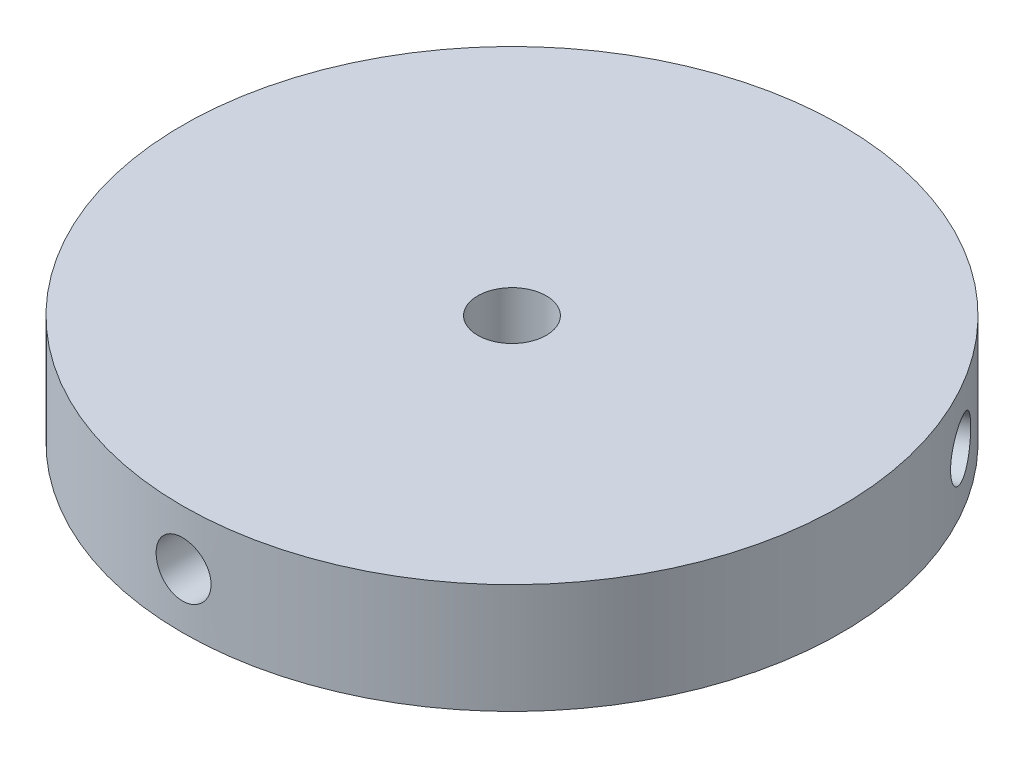
ISO-10303-21;
HEADER;
FILE_DESCRIPTION(('STEP AP214'),'2;1');
FILE_NAME('part.step','',(''),(''),'','','');
FILE_SCHEMA(('AUTOMOTIVE_DESIGN { 1 0 10303 214 1 1 1 1 }'));
ENDSEC;
DATA;
#1=APPLICATION_CONTEXT('core data for automotive mechanical design processes');
#2=APPLICATION_PROTOCOL_DEFINITION('international standard','automotive_design',2000,#1);
#3=PRODUCT_CONTEXT('',#1,'mechanical');
#4=PRODUCT('Part','Part','',(#3));
#5=PRODUCT_RELATED_PRODUCT_CATEGORY('part','',(#4));
#6=PRODUCT_DEFINITION_FORMATION('','',#4);
#7=PRODUCT_DEFINITION_CONTEXT('part definition',#1,'design');
#8=PRODUCT_DEFINITION('design','',#6,#7);
#9=PRODUCT_DEFINITION_SHAPE('','',#8);
#10=(LENGTH_UNIT() NAMED_UNIT(*) SI_UNIT(.MILLI.,.METRE.));
#11=(NAMED_UNIT(*) PLANE_ANGLE_UNIT() SI_UNIT($,.RADIAN.));
#12=(NAMED_UNIT(*) SI_UNIT($,.STERADIAN.) SOLID_ANGLE_UNIT());
#13=UNCERTAINTY_MEASURE_WITH_UNIT(LENGTH_MEASURE(1.E-05),#10,'distance_accuracy_value','');
#14=(GEOMETRIC_REPRESENTATION_CONTEXT(3) GLOBAL_UNCERTAINTY_ASSIGNED_CONTEXT((#13)) GLOBAL_UNIT_ASSIGNED_CONTEXT((#10,
#11,#12)) REPRESENTATION_CONTEXT('',''));
#15=CARTESIAN_POINT('',(0.,0.,0.));
#16=DIRECTION('',(0.,0.,1.));
#17=DIRECTION('',(1.,0.,0.));
#18=AXIS2_PLACEMENT_3D('',#15,#16,#17);
#19=CARTESIAN_POINT('',(0.,12.7,0.));
#20=DIRECTION('',(0.,-1.,0.));
#21=DIRECTION('',(0.,0.,-1.));
#22=AXIS2_PLACEMENT_3D('',#19,#20,#21);
#23=CYLINDRICAL_SURFACE('',#22,38.1);
#24=CARTESIAN_POINT('',(-34.4683003438176,6.35,-16.234108272658));
#25=CARTESIAN_POINT('',(-34.468297976072,6.17199137458612,-16.2341158847225));
#26=CARTESIAN_POINT('',(-34.4618858552339,5.99386156393523,-16.2477491989941));
#27=CARTESIAN_POINT('',(-34.4363107400014,5.6425305603963,-16.3018822251044));
#28=CARTESIAN_POINT('',(-34.4171332977316,5.46933518421718,-16.3424123788068));
#29=CARTESIAN_POINT('',(-34.366317077365,5.13301235230676,-16.4490034875303));
#30=CARTESIAN_POINT('',(-34.3346853637724,4.96987924946927,-16.5150499683885));
#31=CARTESIAN_POINT('',(-34.2594606629624,4.65822285520727,-16.6705362232467));
#32=CARTESIAN_POINT('',(-34.2158702328494,4.50969644967991,-16.7599709959922));
#33=CARTESIAN_POINT('',(-34.1173366400696,4.23104944026374,-16.9596499740052));
#34=CARTESIAN_POINT('',(-34.0623678606117,4.10097150383517,-17.0699410851632));
#35=CARTESIAN_POINT('',(-33.9421339071305,3.86328041719418,-17.3077804703171));
#36=CARTESIAN_POINT('',(-33.8768682834768,3.7556682484669,-17.4353294978764));
#37=CARTESIAN_POINT('',(-33.737247058231,3.56582149846664,-17.7039847598704));
#38=CARTESIAN_POINT('',(-33.6628784508303,3.4836238328989,-17.8451103286139));
#39=CARTESIAN_POINT('',(-33.5067820799427,3.34717551569876,-18.1365058689404));
#40=CARTESIAN_POINT('',(-33.425054445295,3.2929243749007,-18.2867756804144));
#41=CARTESIAN_POINT('',(-33.2564466136483,3.21403191375709,-18.5916382872039));
#42=CARTESIAN_POINT('',(-33.1695789285619,3.18932156419576,-18.7462201371918));
#43=CARTESIAN_POINT('',(-32.9928446235063,3.16999872988892,-19.0555484684848));
#44=CARTESIAN_POINT('',(-32.9029780593362,3.17538568544306,-19.2102949466749));
#45=CARTESIAN_POINT('',(-32.7230679421953,3.2160480896695,-19.5151758231526));
#46=CARTESIAN_POINT('',(-32.6330253824259,3.25124930712833,-19.6653207172342));
#47=CARTESIAN_POINT('',(-32.455300497962,3.35042557930463,-19.9572717533826));
#48=CARTESIAN_POINT('',(-32.3676181957327,3.41440090779409,-20.099077816095));
#49=CARTESIAN_POINT('',(-32.1973421681014,3.56939210910145,-20.3707367785992));
#50=CARTESIAN_POINT('',(-32.1147548504541,3.66044122685106,-20.500574724005));
#51=CARTESIAN_POINT('',(-31.9575816556103,3.86697131601211,-20.7447364600493));
#52=CARTESIAN_POINT('',(-31.8829959407617,3.98245278300083,-20.8590599359205));
#53=CARTESIAN_POINT('',(-31.7442436510404,4.23498784685792,-21.0696221600038));
#54=CARTESIAN_POINT('',(-31.6801094345297,4.3721059459497,-21.1658048829466));
#55=CARTESIAN_POINT('',(-31.5648943395466,4.66379720374434,-21.337247920908));
#56=CARTESIAN_POINT('',(-31.5138134718346,4.81837037683589,-21.4125082186796));
#57=CARTESIAN_POINT('',(-31.4266406902966,5.14062944367546,-21.5402475703534));
#58=CARTESIAN_POINT('',(-31.3905506252527,5.30831695175638,-21.5927238143856));
#59=CARTESIAN_POINT('',(-31.3347797407474,5.65202297981191,-21.6735786683244));
#60=CARTESIAN_POINT('',(-31.315098576307,5.82804132455761,-21.7019577848467));
#61=CARTESIAN_POINT('',(-31.2929612498195,6.18284636731306,-21.7338666549584));
#62=CARTESIAN_POINT('',(-31.290453512958,6.36162315889386,-21.7374708122179));
#63=CARTESIAN_POINT('',(-31.3026261586359,6.71736764108757,-21.7199379609855));
#64=CARTESIAN_POINT('',(-31.3173063808565,6.89433534855898,-21.6988011832619));
#65=CARTESIAN_POINT('',(-31.3632381442978,7.24117917966356,-21.6323577913854));
#66=CARTESIAN_POINT('',(-31.3944658044545,7.41106514343282,-21.5870860080131));
#67=CARTESIAN_POINT('',(-31.4722604845537,7.73922786086988,-21.4735076449162));
#68=CARTESIAN_POINT('',(-31.5188277506256,7.89750442821099,-21.4052006955838));
#69=CARTESIAN_POINT('',(-31.625658837298,8.19836832579616,-21.2470420758724));
#70=CARTESIAN_POINT('',(-31.6859549295945,8.34091749516499,-21.1571396141262));
#71=CARTESIAN_POINT('',(-31.8179507477138,8.6058944623792,-20.9581066008706));
#72=CARTESIAN_POINT('',(-31.8896506697629,8.72832191391536,-20.8489757184932));
#73=CARTESIAN_POINT('',(-32.0420834770884,8.94988813831987,-20.6139398677302));
#74=CARTESIAN_POINT('',(-32.1228383636178,9.04896829078491,-20.487993895069));
#75=CARTESIAN_POINT('',(-32.2904465552361,9.22062517556742,-20.2227998330557));
#76=CARTESIAN_POINT('',(-32.377299799374,9.29320217273015,-20.0835518766475));
#77=CARTESIAN_POINT('',(-32.5541201892432,9.40969188167104,-19.7956494489558));
#78=CARTESIAN_POINT('',(-32.6440832445007,9.45364084358803,-19.64700713605));
#79=CARTESIAN_POINT('',(-32.8244027035133,9.51174540926925,-19.344239928858));
#80=CARTESIAN_POINT('',(-32.9147590997906,9.52590157697375,-19.1901151384045));
#81=CARTESIAN_POINT('',(-33.0929247371073,9.5240121317669,-18.8812083842368));
#82=CARTESIAN_POINT('',(-33.1807408649056,9.50805787666263,-18.7264298255141));
#83=CARTESIAN_POINT('',(-33.3517134701532,9.44659097942587,-18.4202055558323));
#84=CARTESIAN_POINT('',(-33.4348699412735,9.40107829714634,-18.2687598494003));
#85=CARTESIAN_POINT('',(-33.5944347904347,9.28180969986148,-17.9736504896075));
#86=CARTESIAN_POINT('',(-33.6708435602687,9.20805542598165,-17.8299863846097));
#87=CARTESIAN_POINT('',(-33.8151803195636,9.03440774586235,-17.554707776923));
#88=CARTESIAN_POINT('',(-33.8831084431136,8.93451475298456,-17.4230930837273));
#89=CARTESIAN_POINT('',(-34.0092744881184,8.71108235285415,-17.1755245228764));
#90=CARTESIAN_POINT('',(-34.0674837960204,8.58747534677471,-17.0596170818987));
#91=CARTESIAN_POINT('',(-34.1728976712499,8.32024571429507,-16.8474667977872));
#92=CARTESIAN_POINT('',(-34.220099569994,8.17661824768683,-16.7512287238978));
#93=CARTESIAN_POINT('',(-34.3027503932169,7.87314592277449,-16.5813234295435));
#94=CARTESIAN_POINT('',(-34.33817712972,7.71327118124604,-16.5076988393264));
#95=CARTESIAN_POINT('',(-34.396560379629,7.38216888836766,-16.3857026218159));
#96=CARTESIAN_POINT('',(-34.4195312309533,7.21095464582547,-16.3373019618688));
#97=CARTESIAN_POINT('',(-34.4468260209622,6.92394194257855,-16.2796425921257));
#98=CARTESIAN_POINT('',(-34.4548726122663,6.80998938742769,-16.2625924758709));
#99=CARTESIAN_POINT('',(-34.4656105338472,6.5807081899202,-16.2398228644119));
#100=CARTESIAN_POINT('',(-34.4683018785153,6.46537955126236,-16.234103338759));
#101=CARTESIAN_POINT('',(-34.4683003438176,6.35,-16.234108272658));
#102=B_SPLINE_CURVE_WITH_KNOTS('',3,(#24,#25,#26,#27,#28,#29,#30,#31,#32,#33,#34,#35,#36,#37,
#38,#39,#40,#41,#42,#43,#44,#45,#46,#47,#48,#49,#50,#51,#52,#53,#54,#55,#56,#57,#58,#59,#60,#61,
#62,#63,#64,#65,#66,#67,#68,#69,#70,#71,#72,#73,#74,#75,#76,#77,#78,#79,#80,#81,#82,#83,#84,#85,
#86,#87,#88,#89,#90,#91,#92,#93,#94,#95,#96,#97,#98,#99,#100,#101),.UNSPECIFIED.,.T.,.F.,(4,2,2,
2,2,2,2,2,2,2,2,2,2,2,2,2,2,2,2,2,2,2,2,2,2,2,2,2,2,2,2,2,2,2,2,2,2,2,4),(0.,0.533604603517505,
1.06781417349037,1.60172115641093,2.13551406411709,2.67052206526964,3.2055534349789,
3.74135834978334,4.27715388573729,4.81169494296256,5.34622605970216,5.87943020597204,
6.41263942553357,6.94650611589525,7.4803836360617,8.01588389273743,8.55138459084429,
9.08695131145285,9.62250677207596,10.1564531576629,10.6903945629631,11.2235674807547,
11.7567489539102,12.2911969327788,12.8256541089181,13.3614392326626,13.8972190021753,
14.4323190169852,14.9674089029308,15.5008778862256,16.0343475940937,16.5677863066157,
17.1012165837663,17.6361906712906,18.1712943208452,18.7074006261176,19.2428885044878,
19.5887550320896,19.9346206302438),.UNSPECIFIED.);
#103=CARTESIAN_POINT('',(-34.4683003438176,6.35,-16.234108272658));
#104=VERTEX_POINT('',#103);
#105=EDGE_CURVE('E10',#104,#104,#102,.T.);
#106=ORIENTED_EDGE('',*,*,#105,.T.);
#107=EDGE_LOOP('',(#106));
#108=FACE_BOUND('',#107,.T.);
#109=CARTESIAN_POINT('',(31.2933003438179,6.35,-21.7333695866888));
#110=CARTESIAN_POINT('',(31.2933057521863,6.17199137458612,-21.7333637301287));
#111=CARTESIAN_POINT('',(31.3019064882642,5.99386156393522,-21.7209940134549));
#112=CARTESIAN_POINT('',(31.3359995064432,5.64253056039629,-21.6717788009038));
#113=CARTESIAN_POINT('',(31.3615109280339,5.46933518421718,-21.6349055718673));
#114=CARTESIAN_POINT('',(31.4284134258227,5.13301235230676,-21.5376018797438));
#115=CARTESIAN_POINT('',(31.4697954992801,4.96987924946927,-21.4771847717782));
#116=CARTESIAN_POINT('',(31.5668381955216,4.65822285520726,-21.3342951424556));
#117=CARTESIAN_POINT('',(31.6224957656445,4.50969644967991,-21.2518273362431));
#118=CARTESIAN_POINT('',(31.7461560368155,4.23104944026373,-21.0666552527631));
#119=CARTESIAN_POINT('',(31.814186551161,4.10097150383517,-20.9639053377586));
#120=CARTESIAN_POINT('',(31.9600445239842,3.86328041719418,-20.7408599870694));
#121=CARTESIAN_POINT('',(32.0378724102517,3.75566824846689,-20.6205637852119));
#122=CARTESIAN_POINT('',(32.2007240793759,3.56582149846664,-20.3653206262446));
#123=CARTESIAN_POINT('',(32.2857581033309,3.4836238328989,-20.2303527386197));
#124=CARTESIAN_POINT('',(32.4600658583594,3.34717551569876,-19.9494715458292));
#125=CARTESIAN_POINT('',(32.549339515194,3.29292437490069,-19.8035584322961));
#126=CARTESIAN_POINT('',(32.7290543615143,3.21403191375709,-19.5051084634183));
#127=CARTESIAN_POINT('',(32.8194923280245,3.18932156419576,-19.3525879163716));
#128=CARTESIAN_POINT('',(32.9990113685067,3.16999872988893,-19.0448673528267));
#129=CARTESIAN_POINT('',(33.0880924676805,3.17538568544306,-18.8896673862095));
#130=CARTESIAN_POINT('',(33.2621719932678,3.2160480896695,-18.5814202161288));
#131=CARTESIAN_POINT('',(33.3471800059062,3.25124930712834,-18.428368624906));
#132=CARTESIAN_POINT('',(33.5111545776401,3.35042557930463,-18.1284788420014));
#133=CARTESIAN_POINT('',(33.590121079245,3.41440090779409,-17.9816407094523));
#134=CARTESIAN_POINT('',(33.7402466281236,3.56939210910145,-17.698347862616));
#135=CARTESIAN_POINT('',(33.8113959283966,3.66044122685107,-17.5619061748001));
#136=CARTESIAN_POINT('',(33.9442595970212,3.86697131601212,-17.3037093272493));
#137=CARTESIAN_POINT('',(34.0059737739503,3.98245278300083,-17.1819544654954));
#138=CARTESIAN_POINT('',(34.1189498642232,4.23498784685792,-16.9565103457218));
#139=CARTESIAN_POINT('',(34.1701794374414,4.37210594594971,-16.8528771235003));
#140=CARTESIAN_POINT('',(34.2610459161264,4.66379720374434,-16.6673764053648));
#141=CARTESIAN_POINT('',(34.300682812037,4.81837037683589,-16.5855089273931));
#142=CARTESIAN_POINT('',(34.3677219448804,5.14062944367546,-16.4461454082257));
#143=CARTESIAN_POINT('',(34.3951226727856,5.30831695175639,-16.3886523730573));
#144=CARTESIAN_POINT('',(34.4372595880632,5.65202297981191,-16.2999259433149));
#145=CARTESIAN_POINT('',(34.4519960416883,5.82804132455762,-16.2686919966723));
#146=CARTESIAN_POINT('',(34.4685612705673,6.18284636731306,-16.2335660745064));
#147=CARTESIAN_POINT('',(34.4704286938825,6.36162315889387,-16.2295922320485));
#148=CARTESIAN_POINT('',(34.4613311221534,6.71736764108758,-16.248900478053));
#149=CARTESIAN_POINT('',(34.450366246801,6.89433534855898,-16.2721823122911));
#150=CARTESIAN_POINT('',(34.4157904632429,7.24117917966356,-16.3451820822102));
#151=CARTESIAN_POINT('',(34.3921977788462,7.41106514343282,-16.3948619208927));
#152=CARTESIAN_POINT('',(34.3327333711337,7.73922786086988,-16.5190232716864));
#153=CARTESIAN_POINT('',(34.2968614507928,7.89750442821099,-16.5935051817556));
#154=CARTESIAN_POINT('',(34.2133076116314,8.19836832579616,-16.7651029265836));
#155=CARTESIAN_POINT('',(34.1655978420447,8.34091749516499,-16.8622721051343));
#156=CARTESIAN_POINT('',(34.0592281054333,8.6058944623792,-17.0761003434467));
#157=CARTESIAN_POINT('',(34.0005679499816,8.72832191391536,-17.1927597385793));
#158=CARTESIAN_POINT('',(33.8732373360834,8.94988813831987,-17.4422883474749));
#159=CARTESIAN_POINT('',(33.8045423675193,9.04896829078491,-17.5751971170197));
#160=CARTESIAN_POINT('',(33.6586816686921,9.22062517556742,-17.8529470998502));
#161=CARTESIAN_POINT('',(33.5815160230864,9.29320217273015,-17.9977881938788));
#162=CARTESIAN_POINT('',(33.4205954018288,9.40969188167104,-18.2948703572584));
#163=CARTESIAN_POINT('',(33.3368489104038,9.45364084358803,-18.4471018049664));
#164=CARTESIAN_POINT('',(33.1648045470491,9.51174540926925,-18.754646640864));
#165=CARTESIAN_POINT('',(33.076506761302,9.52590157697375,-18.9099599706613));
#166=CARTESIAN_POINT('',(32.8980684834506,9.5240121317669,-19.2187093157428));
#167=CARTESIAN_POINT('',(32.8079343835347,9.50805787666263,-19.3721495926395));
#168=CARTESIAN_POINT('',(32.6282226893587,9.44659097942587,-19.673328346976));
#169=CARTESIAN_POINT('',(32.5386450958546,9.40107829714634,-19.8210668166712));
#170=CARTESIAN_POINT('',(32.3628553179602,9.28180969986148,-20.1068087094923));
#171=CARTESIAN_POINT('',(32.2766429383371,9.20805542598165,-20.2448126977393));
#172=CARTESIAN_POINT('',(32.1104130506095,9.03440774586234,-20.507451301832));
#173=CARTESIAN_POINT('',(32.0303954445657,8.93451475298456,-20.6320861290556));
#174=CARTESIAN_POINT('',(31.8790778041928,8.71108235285415,-20.8651334095502));
#175=CARTESIAN_POINT('',(31.8078036697695,8.58747534677471,-20.9734978694189));
#176=CARTESIAN_POINT('',(31.6767830719237,8.32024571429507,-21.1708641053348));
#177=CARTESIAN_POINT('',(31.6170394044961,8.17661824768683,-21.2598611856987));
#178=CARTESIAN_POINT('',(31.5112225149593,7.87314592277449,-21.4163915454306));
#179=CARTESIAN_POINT('',(31.4651751177397,7.71327118124604,-21.483884294324));
#180=CARTESIAN_POINT('',(31.3887149191645,7.38216888836766,-21.5954437806559));
#181=CARTESIAN_POINT('',(31.3582841437524,7.21095464582547,-21.6395374514229));
#182=CARTESIAN_POINT('',(31.3219970597932,6.92394194257855,-21.6920051178331));
#183=CARTESIAN_POINT('',(31.3112545216311,6.80998938742769,-21.7074987284437));
#184=CARTESIAN_POINT('',(31.2969044204638,6.5807081899202,-21.7281828470462));
#185=CARTESIAN_POINT('',(31.2932968382848,6.46537955126235,-21.7333733827254));
#186=CARTESIAN_POINT('',(31.2933003438179,6.35,-21.7333695866888));
#187=B_SPLINE_CURVE_WITH_KNOTS('',3,(#109,#110,#111,#112,#113,#114,#115,#116,#117,#118,#119,
#120,#121,#122,#123,#124,#125,#126,#127,#128,#129,#130,#131,#132,#133,#134,#135,#136,#137,#138,
#139,#140,#141,#142,#143,#144,#145,#146,#147,#148,#149,#150,#151,#152,#153,#154,#155,#156,#157,
#158,#159,#160,#161,#162,#163,#164,#165,#166,#167,#168,#169,#170,#171,#172,#173,#174,#175,#176,
#177,#178,#179,#180,#181,#182,#183,#184,#185,#186),.UNSPECIFIED.,.T.,.F.,(4,2,2,2,2,2,2,2,2,2,2,
2,2,2,2,2,2,2,2,2,2,2,2,2,2,2,2,2,2,2,2,2,2,2,2,2,2,2,4),(0.,0.533604603517509,1.06781417349037,
1.60172115641093,2.13551406411709,2.67052206526965,3.2055534349789,3.74135834978334,
4.27715388573729,4.81169494296257,5.34622605970217,5.87943020597204,6.41263942553357,
6.94650611589526,7.48038363606171,8.01588389273743,8.55138459084429,9.08695131145285,
9.62250677207596,10.1564531576629,10.6903945629631,11.2235674807547,11.7567489539102,
12.2911969327788,12.8256541089181,13.3614392326626,13.8972190021753,14.4323190169852,
14.9674089029308,15.5008778862256,16.0343475940937,16.5677863066157,17.1012165837663,
17.6361906712906,18.1712943208452,18.7074006261176,19.2428885044878,19.5887550320896,
19.9346206302438),.UNSPECIFIED.);
#188=CARTESIAN_POINT('',(31.2933003438179,6.35,-21.7333695866888));
#189=VERTEX_POINT('',#188);
#190=EDGE_CURVE('E41',#189,#189,#187,.T.);
#191=ORIENTED_EDGE('',*,*,#190,.T.);
#192=EDGE_LOOP('',(#191));
#193=FACE_BOUND('',#192,.T.);
#194=CARTESIAN_POINT('',(3.175,6.35,37.9674778593469));
#195=CARTESIAN_POINT('',(3.174992223886,6.17199137458612,37.9674796148514));
#196=CARTESIAN_POINT('',(3.15997936696993,5.99386156393522,37.9687432124492));
#197=CARTESIAN_POINT('',(3.10031123355846,5.6425305603963,37.9736610260084));
#198=CARTESIAN_POINT('',(3.05562236969804,5.46933518421718,37.9773179506743));
#199=CARTESIAN_POINT('',(2.93790365154258,5.13301235230676,37.9866053672742));
#200=CARTESIAN_POINT('',(2.86488986449255,4.96987924946927,37.9922347401668));
#201=CARTESIAN_POINT('',(2.69262246744107,4.65822285520727,38.0048313657024));
#202=CARTESIAN_POINT('',(2.59337446720523,4.50969644967991,38.0117983322355));
#203=CARTESIAN_POINT('',(2.37118060325433,4.23104944026373,38.0263052267685));
#204=CARTESIAN_POINT('',(2.24818130945098,4.10097150383517,38.033846422922));
#205=CARTESIAN_POINT('',(1.98208938314658,3.86328041719418,38.0486404573867));
#206=CARTESIAN_POINT('',(1.83899587322542,3.75566824846689,38.0558932830884));
#207=CARTESIAN_POINT('',(1.53652297885541,3.56582149846664,38.0693053861151));
#208=CARTESIAN_POINT('',(1.3771203474996,3.4836238328989,38.0754630672337));
#209=CARTESIAN_POINT('',(1.04671622158357,3.34717551569876,38.0859774147697));
#210=CARTESIAN_POINT('',(0.875714930101313,3.29292437490069,38.0903341127107));
#211=CARTESIAN_POINT('',(0.5273922521343,3.21403191375709,38.0967467506223));
#212=CARTESIAN_POINT('',(0.350086600537621,3.18932156419576,38.0988080535635));
#213=CARTESIAN_POINT('',(-0.00616674500017653,3.16999872988893,38.1004158213116));
#214=CARTESIAN_POINT('',(-0.185114408344067,3.17538568544306,38.0999623328846));
#215=CARTESIAN_POINT('',(-0.539104051072237,3.2160480896695,38.0965960392816));
#216=CARTESIAN_POINT('',(-0.71415462348008,3.25124930712834,38.0936893421403));
#217=CARTESIAN_POINT('',(-1.05585407967778,3.35042557930463,38.0857505953842));
#218=CARTESIAN_POINT('',(-1.22250288351202,3.41440090779409,38.0807185255475));
#219=CARTESIAN_POINT('',(-1.54290446002202,3.56939210910145,38.0690846412153));
#220=CARTESIAN_POINT('',(-1.69664107794224,3.66044122685107,38.0624808988053));
#221=CARTESIAN_POINT('',(-1.98667794141065,3.86697131601212,38.0484457872988));
#222=CARTESIAN_POINT('',(-2.12297783318834,3.98245278300083,38.0410144014161));
#223=CARTESIAN_POINT('',(-2.37470621318252,4.23498784685792,38.0261325057258));
#224=CARTESIAN_POINT('',(-2.49007000291146,4.3721059459497,38.0186820064471));
#225=CARTESIAN_POINT('',(-2.69615157657959,4.66379720374434,38.004624326273));
#226=CARTESIAN_POINT('',(-2.78686934020215,4.81837037683589,37.9980171460728));
#227=CARTESIAN_POINT('',(-2.94108125458357,5.14062944367546,37.9863929785793));
#228=CARTESIAN_POINT('',(-3.00457204753268,5.30831695175639,37.9813761874431));
#229=CARTESIAN_POINT('',(-3.10247984731552,5.65202297981191,37.9735046116394));
#230=CARTESIAN_POINT('',(-3.136897465381,5.82804132455761,37.9706497815191));
#231=CARTESIAN_POINT('',(-3.17560002074756,6.18284636731306,37.967432729465));
#232=CARTESIAN_POINT('',(-3.17997518092429,6.36162315889386,37.9670630442666));
#233=CARTESIAN_POINT('',(-3.15870496351731,6.71736764108757,37.9688384390387));
#234=CARTESIAN_POINT('',(-3.13305986594426,6.89433534855898,37.9709834955532));
#235=CARTESIAN_POINT('',(-3.05255231894487,7.24117917966356,37.9775398735957));
#236=CARTESIAN_POINT('',(-2.99773197439151,7.41106514343282,37.981947928906));
#237=CARTESIAN_POINT('',(-2.86047288657974,7.73922786086988,37.9925309166027));
#238=CARTESIAN_POINT('',(-2.77803370016694,7.89750442821099,37.9987058773396));
#239=CARTESIAN_POINT('',(-2.58764877433316,8.19836832579616,38.0121450024561));
#240=CARTESIAN_POINT('',(-2.47964291244999,8.34091749516499,38.0194117192607));
#241=CARTESIAN_POINT('',(-2.24127735771924,8.6058944623792,38.0342069443175));
#242=CARTESIAN_POINT('',(-2.11091728021842,8.72832191391536,38.0417354570727));
#243=CARTESIAN_POINT('',(-1.83115385899479,8.94988813831987,38.0562282152053));
#244=CARTESIAN_POINT('',(-1.68170400390121,9.04896829078492,38.0631910120889));
#245=CARTESIAN_POINT('',(-1.36823511345573,9.22062517556742,38.0757469329061));
#246=CARTESIAN_POINT('',(-1.20421622371214,9.29320217273015,38.0813400705265));
#247=CARTESIAN_POINT('',(-0.866475212585345,9.40969188167104,38.0905198062144));
#248=CARTESIAN_POINT('',(-0.692765665902923,9.45364084358803,38.0941089410165));
#249=CARTESIAN_POINT('',(-0.340401843535498,9.51174540926925,38.0988865697221));
#250=CARTESIAN_POINT('',(-0.161747661511105,9.52590157697375,38.1000751090659));
#251=CARTESIAN_POINT('',(0.194856253656989,9.5240121317669,38.0999176999798));
#252=CARTESIAN_POINT('',(0.37280648137115,9.50805787666263,38.0985794181538));
#253=CARTESIAN_POINT('',(0.723490780794733,9.44659097942587,38.0935339028085));
#254=CARTESIAN_POINT('',(0.89622484541909,9.40107829714634,38.0898266660717));
#255=CARTESIAN_POINT('',(1.23157947247478,9.28180969986148,38.0804591990999));
#256=CARTESIAN_POINT('',(1.39420062193182,9.20805542598165,38.0747990823492));
#257=CARTESIAN_POINT('',(1.70476726895439,9.03440774586234,38.0621590787552));
#258=CARTESIAN_POINT('',(1.85271299854823,8.93451475298456,38.055179212783));
#259=CARTESIAN_POINT('',(2.13019668392583,8.71108235285415,38.0406579324267));
#260=CARTESIAN_POINT('',(2.25968012625115,8.58747534677471,38.0331149513177));
#261=CARTESIAN_POINT('',(2.49611459932655,8.32024571429507,38.0183309031221));
#262=CARTESIAN_POINT('',(2.60306016549813,8.17661824768683,38.0110899095966));
#263=CARTESIAN_POINT('',(2.79152787825786,7.87314592277449,37.9977149749742));
#264=CARTESIAN_POINT('',(2.87300201198062,7.71327118124604,37.9915831336506));
#265=CARTESIAN_POINT('',(3.00784546046481,7.38216888836766,37.981146402472));
#266=CARTESIAN_POINT('',(3.0612470872011,7.21095464582547,37.9768394132918));
#267=CARTESIAN_POINT('',(3.1248289611693,6.92394194257855,37.9716477099589));
#268=CARTESIAN_POINT('',(3.14361809063546,6.80998938742769,37.9700912043147));
#269=CARTESIAN_POINT('',(3.16870611338372,6.5807081899202,37.9680057114582));
#270=CARTESIAN_POINT('',(3.17500504023073,6.46537955126235,37.9674767214846));
#271=CARTESIAN_POINT('',(3.175,6.35,37.9674778593469));
#272=B_SPLINE_CURVE_WITH_KNOTS('',3,(#194,#195,#196,#197,#198,#199,#200,#201,#202,#203,#204,
#205,#206,#207,#208,#209,#210,#211,#212,#213,#214,#215,#216,#217,#218,#219,#220,#221,#222,#223,
#224,#225,#226,#227,#228,#229,#230,#231,#232,#233,#234,#235,#236,#237,#238,#239,#240,#241,#242,
#243,#244,#245,#246,#247,#248,#249,#250,#251,#252,#253,#254,#255,#256,#257,#258,#259,#260,#261,
#262,#263,#264,#265,#266,#267,#268,#269,#270,#271),.UNSPECIFIED.,.T.,.F.,(4,2,2,2,2,2,2,2,2,2,2,
2,2,2,2,2,2,2,2,2,2,2,2,2,2,2,2,2,2,2,2,2,2,2,2,2,2,2,4),(0.,0.533604603517507,1.06781417349037,
1.60172115641093,2.13551406411709,2.67052206526965,3.2055534349789,3.74135834978334,
4.27715388573729,4.81169494296257,5.34622605970216,5.87943020597204,6.41263942553356,
6.94650611589526,7.4803836360617,8.01588389273743,8.55138459084428,9.08695131145285,
9.62250677207596,10.1564531576629,10.6903945629631,11.2235674807547,11.7567489539102,
12.2911969327788,12.8256541089181,13.3614392326626,13.8972190021753,14.4323190169852,
14.9674089029308,15.5008778862256,16.0343475940937,16.5677863066157,17.1012165837663,
17.6361906712906,18.1712943208452,18.7074006261176,19.2428885044878,19.5887550320896,
19.9346206302438),.UNSPECIFIED.);
#273=CARTESIAN_POINT('',(3.175,6.35,37.9674778593469));
#274=VERTEX_POINT('',#273);
#275=EDGE_CURVE('E45',#274,#274,#272,.T.);
#276=ORIENTED_EDGE('',*,*,#275,.T.);
#277=EDGE_LOOP('',(#276));
#278=FACE_BOUND('',#277,.T.);
#279=CARTESIAN_POINT('',(0.,12.7,0.));
#280=DIRECTION('',(0.,1.,0.));
#281=DIRECTION('',(0.,0.,1.));
#282=AXIS2_PLACEMENT_3D('',#279,#280,#281);
#283=CIRCLE('',#282,38.1);
#284=CARTESIAN_POINT('',(0.,12.7,38.1));
#285=VERTEX_POINT('',#284);
#286=EDGE_CURVE('E49',#285,#285,#283,.T.);
#287=ORIENTED_EDGE('',*,*,#286,.F.);
#288=EDGE_LOOP('',(#287));
#289=FACE_BOUND('',#288,.T.);
#290=CARTESIAN_POINT('',(0.,0.,0.));
#291=DIRECTION('',(0.,1.,0.));
#292=DIRECTION('',(0.,0.,1.));
#293=AXIS2_PLACEMENT_3D('',#290,#291,#292);
#294=CIRCLE('',#293,38.1);
#295=CARTESIAN_POINT('',(0.,0.,38.1));
#296=VERTEX_POINT('',#295);
#297=EDGE_CURVE('E96',#296,#296,#294,.T.);
#298=ORIENTED_EDGE('',*,*,#297,.T.);
#299=EDGE_LOOP('',(#298));
#300=FACE_BOUND('',#299,.T.);
#301=ADVANCED_FACE('F30',(#108,#193,#278,#289,#300),#23,.T.);
#302=CARTESIAN_POINT('',(0.,12.7,0.));
#303=DIRECTION('',(0.,1.,0.));
#304=DIRECTION('',(0.,0.,1.));
#305=AXIS2_PLACEMENT_3D('',#302,#303,#304);
#306=PLANE('',#305);
#307=CARTESIAN_POINT('',(0.,12.7,0.));
#308=DIRECTION('',(0.,1.,0.));
#309=DIRECTION('',(0.,0.,1.));
#310=AXIS2_PLACEMENT_3D('',#307,#308,#309);
#311=CIRCLE('',#310,3.9624);
#312=CARTESIAN_POINT('',(0.,12.7,3.9624));
#313=VERTEX_POINT('',#312);
#314=EDGE_CURVE('E111',#313,#313,#311,.T.);
#315=ORIENTED_EDGE('',*,*,#314,.F.);
#316=EDGE_LOOP('',(#315));
#317=FACE_BOUND('',#316,.T.);
#318=ORIENTED_EDGE('',*,*,#286,.T.);
#319=EDGE_LOOP('',(#318));
#320=FACE_BOUND('',#319,.T.);
#321=ADVANCED_FACE('F76',(#317,#320),#306,.T.);
#322=CARTESIAN_POINT('',(0.,0.,0.));
#323=DIRECTION('',(0.,1.,0.));
#324=DIRECTION('',(0.,0.,1.));
#325=AXIS2_PLACEMENT_3D('',#322,#323,#324);
#326=PLANE('',#325);
#327=CARTESIAN_POINT('',(0.,0.,0.));
#328=DIRECTION('',(0.,1.,0.));
#329=DIRECTION('',(0.,0.,1.));
#330=AXIS2_PLACEMENT_3D('',#327,#328,#329);
#331=CIRCLE('',#330,3.9624);
#332=CARTESIAN_POINT('',(0.,0.,3.9624));
#333=VERTEX_POINT('',#332);
#334=EDGE_CURVE('E106',#333,#333,#331,.F.);
#335=ORIENTED_EDGE('',*,*,#334,.F.);
#336=EDGE_LOOP('',(#335));
#337=FACE_BOUND('',#336,.T.);
#338=ORIENTED_EDGE('',*,*,#297,.F.);
#339=EDGE_LOOP('',(#338));
#340=FACE_BOUND('',#339,.T.);
#341=ADVANCED_FACE('F74',(#337,#340),#326,.F.);
#342=CARTESIAN_POINT('',(0.,6.35,28.575));
#343=DIRECTION('',(0.,0.,1.));
#344=DIRECTION('',(1.,0.,0.));
#345=AXIS2_PLACEMENT_3D('',#342,#343,#344);
#346=CYLINDRICAL_SURFACE('',#345,3.175);
#347=CARTESIAN_POINT('',(0.,6.35,28.575));
#348=DIRECTION('',(0.,0.,1.));
#349=DIRECTION('',(1.,0.,0.));
#350=AXIS2_PLACEMENT_3D('',#347,#348,#349);
#351=CIRCLE('',#350,3.175);
#352=CARTESIAN_POINT('',(3.175,6.35,28.575));
#353=VERTEX_POINT('',#352);
#354=EDGE_CURVE('E97',#353,#353,#351,.T.);
#355=ORIENTED_EDGE('',*,*,#354,.F.);
#356=EDGE_LOOP('',(#355));
#357=FACE_BOUND('',#356,.T.);
#358=ORIENTED_EDGE('',*,*,#275,.F.);
#359=EDGE_LOOP('',(#358));
#360=FACE_BOUND('',#359,.T.);
#361=ADVANCED_FACE('F69',(#357,#360),#346,.F.);
#362=CARTESIAN_POINT('',(0.,6.35,28.575));
#363=DIRECTION('',(0.,0.,1.));
#364=DIRECTION('',(1.,0.,0.));
#365=AXIS2_PLACEMENT_3D('',#362,#363,#364);
#366=PLANE('',#365);
#367=ORIENTED_EDGE('',*,*,#354,.T.);
#368=EDGE_LOOP('',(#367));
#369=FACE_BOUND('',#368,.T.);
#370=ADVANCED_FACE('F66',(#369),#366,.T.);
#371=CARTESIAN_POINT('',(24.7466759131405,6.35,-14.2874999999998));
#372=DIRECTION('',(0.866025403784443,0.,-0.499999999999992));
#373=DIRECTION('',(-0.499999999999992,0.,-0.866025403784443));
#374=AXIS2_PLACEMENT_3D('',#371,#372,#373);
#375=CYLINDRICAL_SURFACE('',#374,3.175);
#376=CARTESIAN_POINT('',(24.7466759131405,6.35,-14.2874999999998));
#377=DIRECTION('',(0.866025403784443,0.,-0.499999999999992));
#378=DIRECTION('',(-0.499999999999992,0.,-0.866025403784443));
#379=AXIS2_PLACEMENT_3D('',#376,#377,#378);
#380=CIRCLE('',#379,3.175);
#381=CARTESIAN_POINT('',(23.1591759131405,6.35,-17.0371306570154));
#382=VERTEX_POINT('',#381);
#383=EDGE_CURVE('E103',#382,#382,#380,.T.);
#384=ORIENTED_EDGE('',*,*,#383,.F.);
#385=EDGE_LOOP('',(#384));
#386=FACE_BOUND('',#385,.T.);
#387=ORIENTED_EDGE('',*,*,#190,.F.);
#388=EDGE_LOOP('',(#387));
#389=FACE_BOUND('',#388,.T.);
#390=ADVANCED_FACE('F60',(#386,#389),#375,.F.);
#391=CARTESIAN_POINT('',(24.7466759131405,6.35,-14.2874999999998));
#392=DIRECTION('',(0.866025403784443,0.,-0.499999999999992));
#393=DIRECTION('',(-0.499999999999992,0.,-0.866025403784443));
#394=AXIS2_PLACEMENT_3D('',#391,#392,#393);
#395=PLANE('',#394);
#396=ORIENTED_EDGE('',*,*,#383,.T.);
#397=EDGE_LOOP('',(#396));
#398=FACE_BOUND('',#397,.T.);
#399=ADVANCED_FACE('F65',(#398),#395,.T.);
#400=CARTESIAN_POINT('',(-24.7466759131403,6.35,-14.2875000000001));
#401=DIRECTION('',(-0.866025403784436,0.,-0.500000000000004));
#402=DIRECTION('',(-0.500000000000004,0.,0.866025403784436));
#403=AXIS2_PLACEMENT_3D('',#400,#401,#402);
#404=CYLINDRICAL_SURFACE('',#403,3.175);
#405=CARTESIAN_POINT('',(-24.7466759131403,6.35,-14.2875000000001));
#406=DIRECTION('',(-0.866025403784436,0.,-0.500000000000004));
#407=DIRECTION('',(-0.500000000000004,0.,0.866025403784436));
#408=AXIS2_PLACEMENT_3D('',#405,#406,#407);
#409=CIRCLE('',#408,3.175);
#410=CARTESIAN_POINT('',(-26.3341759131403,6.35,-11.5378693429845));
#411=VERTEX_POINT('',#410);
#412=EDGE_CURVE('E100',#411,#411,#409,.T.);
#413=ORIENTED_EDGE('',*,*,#412,.F.);
#414=EDGE_LOOP('',(#413));
#415=FACE_BOUND('',#414,.T.);
#416=ORIENTED_EDGE('',*,*,#105,.F.);
#417=EDGE_LOOP('',(#416));
#418=FACE_BOUND('',#417,.T.);
#419=ADVANCED_FACE('F124',(#415,#418),#404,.F.);
#420=CARTESIAN_POINT('',(-24.7466759131403,6.35,-14.2875000000001));
#421=DIRECTION('',(-0.866025403784436,0.,-0.500000000000004));
#422=DIRECTION('',(-0.500000000000004,0.,0.866025403784436));
#423=AXIS2_PLACEMENT_3D('',#420,#421,#422);
#424=PLANE('',#423);
#425=ORIENTED_EDGE('',*,*,#412,.T.);
#426=EDGE_LOOP('',(#425));
#427=FACE_BOUND('',#426,.T.);
#428=ADVANCED_FACE('F118',(#427),#424,.T.);
#429=CARTESIAN_POINT('',(0.,-11.2073596390943,0.));
#430=DIRECTION('',(0.,1.,0.));
#431=DIRECTION('',(0.,0.,1.));
#432=AXIS2_PLACEMENT_3D('',#429,#430,#431);
#433=CYLINDRICAL_SURFACE('',#432,3.9624);
#434=ORIENTED_EDGE('',*,*,#334,.T.);
#435=EDGE_LOOP('',(#434));
#436=FACE_BOUND('',#435,.T.);
#437=ORIENTED_EDGE('',*,*,#314,.T.);
#438=EDGE_LOOP('',(#437));
#439=FACE_BOUND('',#438,.T.);
#440=ADVANCED_FACE('F115',(#436,#439),#433,.F.);
#441=CLOSED_SHELL('',(#301,#321,#341,#361,#370,#390,#399,#419,#428,#440));
#442=MANIFOLD_SOLID_BREP('B2',#441);
#443=ADVANCED_BREP_SHAPE_REPRESENTATION('',(#18,#442),#14);
#444=SHAPE_DEFINITION_REPRESENTATION(#9,#443);
ENDSEC;
END-ISO-10303-21;
